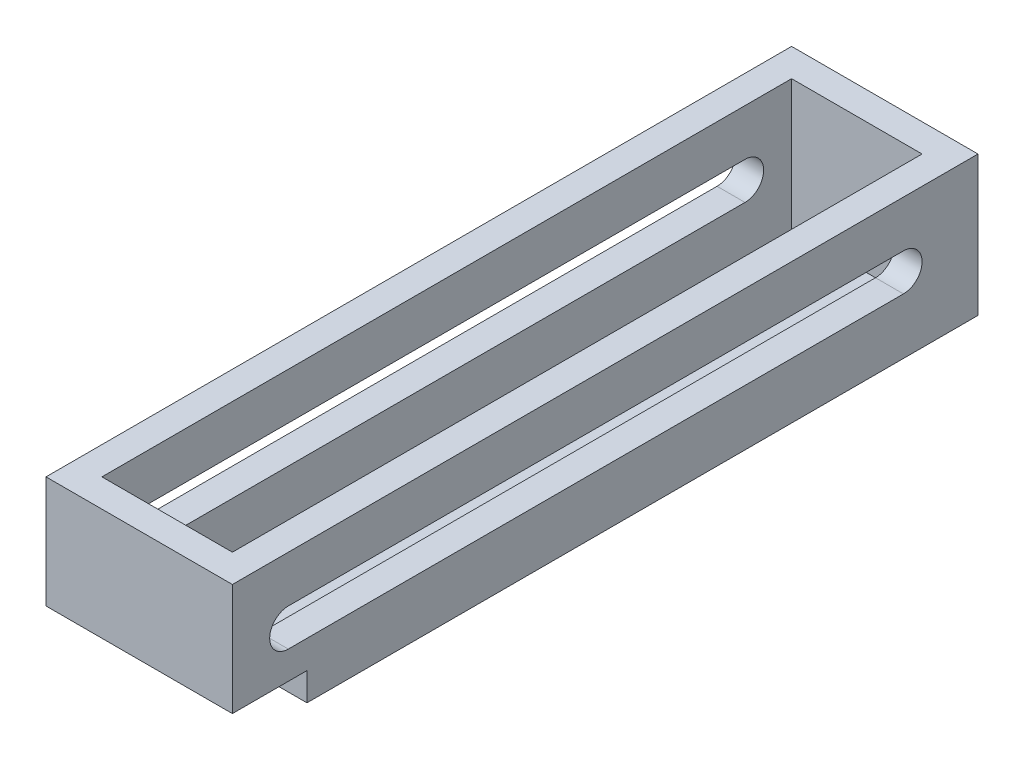
ISO-10303-21;
HEADER;
FILE_DESCRIPTION(('STEP AP214'),'2;1');
FILE_NAME('part.step','',(''),(''),'','','');
FILE_SCHEMA(('AUTOMOTIVE_DESIGN { 1 0 10303 214 1 1 1 1 }'));
ENDSEC;
DATA;
#1=APPLICATION_CONTEXT('core data for automotive mechanical design processes');
#2=APPLICATION_PROTOCOL_DEFINITION('international standard','automotive_design',2000,#1);
#3=PRODUCT_CONTEXT('',#1,'mechanical');
#4=PRODUCT('Part','Part','',(#3));
#5=PRODUCT_RELATED_PRODUCT_CATEGORY('part','',(#4));
#6=PRODUCT_DEFINITION_FORMATION('','',#4);
#7=PRODUCT_DEFINITION_CONTEXT('part definition',#1,'design');
#8=PRODUCT_DEFINITION('design','',#6,#7);
#9=PRODUCT_DEFINITION_SHAPE('','',#8);
#10=(LENGTH_UNIT() NAMED_UNIT(*) SI_UNIT(.MILLI.,.METRE.));
#11=(NAMED_UNIT(*) PLANE_ANGLE_UNIT() SI_UNIT($,.RADIAN.));
#12=(NAMED_UNIT(*) SI_UNIT($,.STERADIAN.) SOLID_ANGLE_UNIT());
#13=UNCERTAINTY_MEASURE_WITH_UNIT(LENGTH_MEASURE(1.E-05),#10,'distance_accuracy_value','');
#14=(GEOMETRIC_REPRESENTATION_CONTEXT(3) GLOBAL_UNCERTAINTY_ASSIGNED_CONTEXT((#13)) GLOBAL_UNIT_ASSIGNED_CONTEXT((#10,
#11,#12)) REPRESENTATION_CONTEXT('',''));
#15=CARTESIAN_POINT('',(0.,0.,0.));
#16=DIRECTION('',(0.,0.,1.));
#17=DIRECTION('',(1.,0.,0.));
#18=AXIS2_PLACEMENT_3D('',#15,#16,#17);
#19=CARTESIAN_POINT('',(63.5,95.25,-254.));
#20=DIRECTION('',(-1.,0.,0.));
#21=DIRECTION('',(0.,0.,1.));
#22=AXIS2_PLACEMENT_3D('',#19,#20,#21);
#23=PLANE('',#22);
#24=DIRECTION('',(0.,0.,1.));
#25=VECTOR('',#24,1.);
#26=CARTESIAN_POINT('',(63.5,63.5,-203.2));
#27=LINE('',#26,#25);
#28=CARTESIAN_POINT('',(63.5,63.5,-203.2));
#29=VERTEX_POINT('',#28);
#30=CARTESIAN_POINT('',(63.5,63.4999999999999,215.9));
#31=VERTEX_POINT('',#30);
#32=EDGE_CURVE('E318',#29,#31,#27,.T.);
#33=ORIENTED_EDGE('',*,*,#32,.F.);
#34=CARTESIAN_POINT('',(63.5,50.8,-203.2));
#35=DIRECTION('',(1.,0.,0.));
#36=DIRECTION('',(0.,0.,-1.));
#37=AXIS2_PLACEMENT_3D('',#34,#35,#36);
#38=CIRCLE('',#37,12.7);
#39=CARTESIAN_POINT('',(63.5,38.1,-203.2));
#40=VERTEX_POINT('',#39);
#41=EDGE_CURVE('E302',#40,#29,#38,.T.);
#42=ORIENTED_EDGE('',*,*,#41,.F.);
#43=DIRECTION('',(0.,0.,-1.));
#44=VECTOR('',#43,1.);
#45=CARTESIAN_POINT('',(63.5,38.1,-203.2));
#46=LINE('',#45,#44);
#47=CARTESIAN_POINT('',(63.5,38.1,215.9));
#48=VERTEX_POINT('',#47);
#49=EDGE_CURVE('E307',#48,#40,#46,.T.);
#50=ORIENTED_EDGE('',*,*,#49,.F.);
#51=CARTESIAN_POINT('',(63.5,50.7999999999999,215.9));
#52=DIRECTION('',(1.,0.,0.));
#53=DIRECTION('',(0.,0.,-1.));
#54=AXIS2_PLACEMENT_3D('',#51,#52,#53);
#55=CIRCLE('',#54,12.7);
#56=EDGE_CURVE('E321',#31,#48,#55,.T.);
#57=ORIENTED_EDGE('',*,*,#56,.F.);
#58=EDGE_LOOP('',(#33,#42,#50,#57));
#59=FACE_BOUND('',#58,.T.);
#60=DIRECTION('',(0.,-1.,0.));
#61=VECTOR('',#60,1.);
#62=CARTESIAN_POINT('',(63.5,95.25,254.));
#63=LINE('',#62,#61);
#64=CARTESIAN_POINT('',(63.5,95.25,254.));
#65=VERTEX_POINT('',#64);
#66=CARTESIAN_POINT('',(63.5,19.05,254.));
#67=VERTEX_POINT('',#66);
#68=EDGE_CURVE('E204',#65,#67,#63,.T.);
#69=ORIENTED_EDGE('',*,*,#68,.T.);
#70=DIRECTION('',(0.,0.,1.));
#71=VECTOR('',#70,1.);
#72=CARTESIAN_POINT('',(63.5,19.05,203.2));
#73=LINE('',#72,#71);
#74=CARTESIAN_POINT('',(63.5,19.05,203.2));
#75=VERTEX_POINT('',#74);
#76=EDGE_CURVE('E186',#75,#67,#73,.T.);
#77=ORIENTED_EDGE('',*,*,#76,.F.);
#78=DIRECTION('',(0.,1.,0.));
#79=VECTOR('',#78,1.);
#80=CARTESIAN_POINT('',(63.5,19.05,203.2));
#81=LINE('',#80,#79);
#82=CARTESIAN_POINT('',(63.5,0.,203.2));
#83=VERTEX_POINT('',#82);
#84=EDGE_CURVE('E173',#83,#75,#81,.T.);
#85=ORIENTED_EDGE('',*,*,#84,.F.);
#86=DIRECTION('',(0.,0.,-1.));
#87=VECTOR('',#86,1.);
#88=CARTESIAN_POINT('',(63.5,0.,-254.));
#89=LINE('',#88,#87);
#90=CARTESIAN_POINT('',(63.5,0.,-254.));
#91=VERTEX_POINT('',#90);
#92=EDGE_CURVE('E184',#83,#91,#89,.T.);
#93=ORIENTED_EDGE('',*,*,#92,.T.);
#94=DIRECTION('',(0.,-1.,0.));
#95=VECTOR('',#94,1.);
#96=CARTESIAN_POINT('',(63.5,95.25,-254.));
#97=LINE('',#96,#95);
#98=CARTESIAN_POINT('',(63.5,95.25,-254.));
#99=VERTEX_POINT('',#98);
#100=EDGE_CURVE('E212',#99,#91,#97,.T.);
#101=ORIENTED_EDGE('',*,*,#100,.F.);
#102=DIRECTION('',(0.,0.,-1.));
#103=VECTOR('',#102,1.);
#104=CARTESIAN_POINT('',(63.5,95.25,-254.));
#105=LINE('',#104,#103);
#106=EDGE_CURVE('E203',#65,#99,#105,.T.);
#107=ORIENTED_EDGE('',*,*,#106,.F.);
#108=EDGE_LOOP('',(#69,#77,#85,#93,#101,#107));
#109=FACE_BOUND('',#108,.T.);
#110=ADVANCED_FACE('F37',(#59,#109),#23,.F.);
#111=CARTESIAN_POINT('',(-63.5,95.25,-254.));
#112=DIRECTION('',(0.,0.,1.));
#113=DIRECTION('',(1.,0.,0.));
#114=AXIS2_PLACEMENT_3D('',#111,#112,#113);
#115=PLANE('',#114);
#116=DIRECTION('',(-1.,0.,0.));
#117=VECTOR('',#116,1.);
#118=CARTESIAN_POINT('',(-63.5,0.,-254.));
#119=LINE('',#118,#117);
#120=CARTESIAN_POINT('',(-63.5,0.,-254.));
#121=VERTEX_POINT('',#120);
#122=EDGE_CURVE('E190',#91,#121,#119,.T.);
#123=ORIENTED_EDGE('',*,*,#122,.T.);
#124=DIRECTION('',(0.,-1.,0.));
#125=VECTOR('',#124,1.);
#126=CARTESIAN_POINT('',(-63.5,95.25,-254.));
#127=LINE('',#126,#125);
#128=CARTESIAN_POINT('',(-63.5,95.25,-254.));
#129=VERTEX_POINT('',#128);
#130=EDGE_CURVE('E209',#129,#121,#127,.T.);
#131=ORIENTED_EDGE('',*,*,#130,.F.);
#132=DIRECTION('',(-1.,0.,0.));
#133=VECTOR('',#132,1.);
#134=CARTESIAN_POINT('',(-63.5,95.25,-254.));
#135=LINE('',#134,#133);
#136=EDGE_CURVE('E265',#99,#129,#135,.T.);
#137=ORIENTED_EDGE('',*,*,#136,.F.);
#138=ORIENTED_EDGE('',*,*,#100,.T.);
#139=EDGE_LOOP('',(#123,#131,#137,#138));
#140=FACE_BOUND('',#139,.T.);
#141=ADVANCED_FACE('F279',(#140),#115,.F.);
#142=CARTESIAN_POINT('',(-63.5,95.25,-254.));
#143=DIRECTION('',(1.,0.,0.));
#144=DIRECTION('',(0.,0.,-1.));
#145=AXIS2_PLACEMENT_3D('',#142,#143,#144);
#146=PLANE('',#145);
#147=DIRECTION('',(0.,0.,-1.));
#148=VECTOR('',#147,1.);
#149=CARTESIAN_POINT('',(-63.5000000000001,38.1,-203.2));
#150=LINE('',#149,#148);
#151=CARTESIAN_POINT('',(-63.5,38.1,215.9));
#152=VERTEX_POINT('',#151);
#153=CARTESIAN_POINT('',(-63.5000000000001,38.1,-203.2));
#154=VERTEX_POINT('',#153);
#155=EDGE_CURVE('E313',#152,#154,#150,.T.);
#156=ORIENTED_EDGE('',*,*,#155,.T.);
#157=CARTESIAN_POINT('',(-63.5000000000001,50.8,-203.2));
#158=DIRECTION('',(1.,0.,0.));
#159=DIRECTION('',(0.,0.,-1.));
#160=AXIS2_PLACEMENT_3D('',#157,#158,#159);
#161=CIRCLE('',#160,12.7);
#162=CARTESIAN_POINT('',(-63.5000000000001,63.5,-203.2));
#163=VERTEX_POINT('',#162);
#164=EDGE_CURVE('E303',#154,#163,#161,.T.);
#165=ORIENTED_EDGE('',*,*,#164,.T.);
#166=DIRECTION('',(0.,0.,1.));
#167=VECTOR('',#166,1.);
#168=CARTESIAN_POINT('',(-63.5000000000001,63.5,-203.2));
#169=LINE('',#168,#167);
#170=CARTESIAN_POINT('',(-63.5,63.4999999999999,215.9));
#171=VERTEX_POINT('',#170);
#172=EDGE_CURVE('E306',#163,#171,#169,.T.);
#173=ORIENTED_EDGE('',*,*,#172,.T.);
#174=CARTESIAN_POINT('',(-63.5,50.7999999999999,215.9));
#175=DIRECTION('',(1.,0.,0.));
#176=DIRECTION('',(0.,0.,-1.));
#177=AXIS2_PLACEMENT_3D('',#174,#175,#176);
#178=CIRCLE('',#177,12.7);
#179=EDGE_CURVE('E310',#171,#152,#178,.T.);
#180=ORIENTED_EDGE('',*,*,#179,.T.);
#181=EDGE_LOOP('',(#156,#165,#173,#180));
#182=FACE_BOUND('',#181,.T.);
#183=DIRECTION('',(0.,-1.,0.));
#184=VECTOR('',#183,1.);
#185=CARTESIAN_POINT('',(-63.5,0.,203.2));
#186=LINE('',#185,#184);
#187=CARTESIAN_POINT('',(-63.5,19.05,203.2));
#188=VERTEX_POINT('',#187);
#189=CARTESIAN_POINT('',(-63.5,0.,203.2));
#190=VERTEX_POINT('',#189);
#191=EDGE_CURVE('E51',#188,#190,#186,.T.);
#192=ORIENTED_EDGE('',*,*,#191,.F.);
#193=DIRECTION('',(0.,0.,1.));
#194=VECTOR('',#193,1.);
#195=CARTESIAN_POINT('',(-63.5,19.05,203.2));
#196=LINE('',#195,#194);
#197=CARTESIAN_POINT('',(-63.5,19.05,254.));
#198=VERTEX_POINT('',#197);
#199=EDGE_CURVE('E285',#188,#198,#196,.T.);
#200=ORIENTED_EDGE('',*,*,#199,.T.);
#201=DIRECTION('',(0.,-1.,0.));
#202=VECTOR('',#201,1.);
#203=CARTESIAN_POINT('',(-63.5,95.25,254.));
#204=LINE('',#203,#202);
#205=CARTESIAN_POINT('',(-63.5,95.25,254.));
#206=VERTEX_POINT('',#205);
#207=EDGE_CURVE('E206',#206,#198,#204,.T.);
#208=ORIENTED_EDGE('',*,*,#207,.F.);
#209=DIRECTION('',(0.,0.,1.));
#210=VECTOR('',#209,1.);
#211=CARTESIAN_POINT('',(-63.5,95.25,-254.));
#212=LINE('',#211,#210);
#213=EDGE_CURVE('E266',#129,#206,#212,.T.);
#214=ORIENTED_EDGE('',*,*,#213,.F.);
#215=ORIENTED_EDGE('',*,*,#130,.T.);
#216=DIRECTION('',(0.,0.,1.));
#217=VECTOR('',#216,1.);
#218=CARTESIAN_POINT('',(-63.5,0.,-254.));
#219=LINE('',#218,#217);
#220=EDGE_CURVE('E194',#121,#190,#219,.T.);
#221=ORIENTED_EDGE('',*,*,#220,.T.);
#222=EDGE_LOOP('',(#192,#200,#208,#214,#215,#221));
#223=FACE_BOUND('',#222,.T.);
#224=ADVANCED_FACE('F282',(#182,#223),#146,.F.);
#225=CARTESIAN_POINT('',(-63.5,95.25,254.));
#226=DIRECTION('',(0.,0.,-1.));
#227=DIRECTION('',(-1.,0.,0.));
#228=AXIS2_PLACEMENT_3D('',#225,#226,#227);
#229=PLANE('',#228);
#230=ORIENTED_EDGE('',*,*,#207,.T.);
#231=DIRECTION('',(-1.,0.,0.));
#232=VECTOR('',#231,1.);
#233=CARTESIAN_POINT('',(-63.5,19.05,254.));
#234=LINE('',#233,#232);
#235=EDGE_CURVE('E277',#67,#198,#234,.T.);
#236=ORIENTED_EDGE('',*,*,#235,.F.);
#237=ORIENTED_EDGE('',*,*,#68,.F.);
#238=DIRECTION('',(1.,0.,0.));
#239=VECTOR('',#238,1.);
#240=CARTESIAN_POINT('',(-63.5,95.25,254.));
#241=LINE('',#240,#239);
#242=EDGE_CURVE('E199',#206,#65,#241,.T.);
#243=ORIENTED_EDGE('',*,*,#242,.F.);
#244=EDGE_LOOP('',(#230,#236,#237,#243));
#245=FACE_BOUND('',#244,.T.);
#246=ADVANCED_FACE('F276',(#245),#229,.F.);
#247=CARTESIAN_POINT('',(0.,95.25,0.));
#248=DIRECTION('',(0.,1.,0.));
#249=DIRECTION('',(0.,0.,1.));
#250=AXIS2_PLACEMENT_3D('',#247,#248,#249);
#251=PLANE('',#250);
#252=DIRECTION('',(0.,0.,1.));
#253=VECTOR('',#252,1.);
#254=CARTESIAN_POINT('',(-44.45,95.25,234.95));
#255=LINE('',#254,#253);
#256=CARTESIAN_POINT('',(-44.45,95.25,-234.95));
#257=VERTEX_POINT('',#256);
#258=CARTESIAN_POINT('',(-44.45,95.25,234.95));
#259=VERTEX_POINT('',#258);
#260=EDGE_CURVE('E248',#257,#259,#255,.T.);
#261=ORIENTED_EDGE('',*,*,#260,.F.);
#262=DIRECTION('',(-1.,0.,0.));
#263=VECTOR('',#262,1.);
#264=CARTESIAN_POINT('',(-44.45,95.25,-234.95));
#265=LINE('',#264,#263);
#266=CARTESIAN_POINT('',(44.45,95.25,-234.95));
#267=VERTEX_POINT('',#266);
#268=EDGE_CURVE('E244',#267,#257,#265,.T.);
#269=ORIENTED_EDGE('',*,*,#268,.F.);
#270=DIRECTION('',(0.,0.,-1.));
#271=VECTOR('',#270,1.);
#272=CARTESIAN_POINT('',(44.45,95.25,-234.95));
#273=LINE('',#272,#271);
#274=CARTESIAN_POINT('',(44.4500000000001,95.25,234.95));
#275=VERTEX_POINT('',#274);
#276=EDGE_CURVE('E255',#275,#267,#273,.T.);
#277=ORIENTED_EDGE('',*,*,#276,.F.);
#278=DIRECTION('',(1.,0.,0.));
#279=VECTOR('',#278,1.);
#280=CARTESIAN_POINT('',(44.4500000000001,95.25,234.95));
#281=LINE('',#280,#279);
#282=EDGE_CURVE('E251',#259,#275,#281,.T.);
#283=ORIENTED_EDGE('',*,*,#282,.F.);
#284=EDGE_LOOP('',(#261,#269,#277,#283));
#285=FACE_BOUND('',#284,.T.);
#286=ORIENTED_EDGE('',*,*,#106,.T.);
#287=ORIENTED_EDGE('',*,*,#136,.T.);
#288=ORIENTED_EDGE('',*,*,#213,.T.);
#289=ORIENTED_EDGE('',*,*,#242,.T.);
#290=EDGE_LOOP('',(#286,#287,#288,#289));
#291=FACE_BOUND('',#290,.T.);
#292=ADVANCED_FACE('F272',(#285,#291),#251,.T.);
#293=CARTESIAN_POINT('',(0.,0.,0.));
#294=DIRECTION('',(0.,1.,0.));
#295=DIRECTION('',(0.,0.,1.));
#296=AXIS2_PLACEMENT_3D('',#293,#294,#295);
#297=PLANE('',#296);
#298=ORIENTED_EDGE('',*,*,#92,.F.);
#299=DIRECTION('',(1.,0.,0.));
#300=VECTOR('',#299,1.);
#301=CARTESIAN_POINT('',(63.5,0.,203.2));
#302=LINE('',#301,#300);
#303=EDGE_CURVE('E170',#190,#83,#302,.T.);
#304=ORIENTED_EDGE('',*,*,#303,.F.);
#305=ORIENTED_EDGE('',*,*,#220,.F.);
#306=ORIENTED_EDGE('',*,*,#122,.F.);
#307=EDGE_LOOP('',(#298,#304,#305,#306));
#308=FACE_BOUND('',#307,.T.);
#309=ADVANCED_FACE('F189',(#308),#297,.F.);
#310=CARTESIAN_POINT('',(-44.45,6.35000000000001,234.95));
#311=DIRECTION('',(-1.,0.,0.));
#312=DIRECTION('',(0.,0.,1.));
#313=AXIS2_PLACEMENT_3D('',#310,#311,#312);
#314=PLANE('',#313);
#315=DIRECTION('',(0.,0.,-1.));
#316=VECTOR('',#315,1.);
#317=CARTESIAN_POINT('',(-44.45,63.4999999999999,234.95));
#318=LINE('',#317,#316);
#319=CARTESIAN_POINT('',(-44.45,63.4999999999999,215.9));
#320=VERTEX_POINT('',#319);
#321=CARTESIAN_POINT('',(-44.45,63.5,-203.2));
#322=VERTEX_POINT('',#321);
#323=EDGE_CURVE('E329',#320,#322,#318,.T.);
#324=ORIENTED_EDGE('',*,*,#323,.T.);
#325=CARTESIAN_POINT('',(-44.45,50.8,-203.2));
#326=DIRECTION('',(-1.,0.,0.));
#327=DIRECTION('',(0.,0.,1.));
#328=AXIS2_PLACEMENT_3D('',#325,#326,#327);
#329=CIRCLE('',#328,12.7);
#330=CARTESIAN_POINT('',(-44.45,38.1,-203.2));
#331=VERTEX_POINT('',#330);
#332=EDGE_CURVE('E252',#322,#331,#329,.T.);
#333=ORIENTED_EDGE('',*,*,#332,.T.);
#334=DIRECTION('',(0.,0.,1.));
#335=VECTOR('',#334,1.);
#336=CARTESIAN_POINT('',(-44.45,38.1,234.95));
#337=LINE('',#336,#335);
#338=CARTESIAN_POINT('',(-44.45,38.1,215.9));
#339=VERTEX_POINT('',#338);
#340=EDGE_CURVE('E346',#331,#339,#337,.T.);
#341=ORIENTED_EDGE('',*,*,#340,.T.);
#342=CARTESIAN_POINT('',(-44.45,50.7999999999999,215.9));
#343=DIRECTION('',(-1.,0.,0.));
#344=DIRECTION('',(0.,0.,1.));
#345=AXIS2_PLACEMENT_3D('',#342,#343,#344);
#346=CIRCLE('',#345,12.7);
#347=EDGE_CURVE('E343',#339,#320,#346,.T.);
#348=ORIENTED_EDGE('',*,*,#347,.T.);
#349=EDGE_LOOP('',(#324,#333,#341,#348));
#350=FACE_BOUND('',#349,.T.);
#351=DIRECTION('',(0.,1.,0.));
#352=VECTOR('',#351,1.);
#353=CARTESIAN_POINT('',(-44.45,6.35000000000001,234.95));
#354=LINE('',#353,#352);
#355=CARTESIAN_POINT('',(-44.45,19.05,234.95));
#356=VERTEX_POINT('',#355);
#357=EDGE_CURVE('E242',#356,#259,#354,.T.);
#358=ORIENTED_EDGE('',*,*,#357,.F.);
#359=DIRECTION('',(0.,0.,-1.));
#360=VECTOR('',#359,1.);
#361=CARTESIAN_POINT('',(-44.45,19.05,234.95));
#362=LINE('',#361,#360);
#363=CARTESIAN_POINT('',(-44.45,19.05,203.2));
#364=VERTEX_POINT('',#363);
#365=EDGE_CURVE('E299',#356,#364,#362,.T.);
#366=ORIENTED_EDGE('',*,*,#365,.T.);
#367=DIRECTION('',(0.,-1.,0.));
#368=VECTOR('',#367,1.);
#369=CARTESIAN_POINT('',(-44.45,6.35000000000001,203.2));
#370=LINE('',#369,#368);
#371=CARTESIAN_POINT('',(-44.45,6.35000000000001,203.2));
#372=VERTEX_POINT('',#371);
#373=EDGE_CURVE('E289',#364,#372,#370,.T.);
#374=ORIENTED_EDGE('',*,*,#373,.T.);
#375=DIRECTION('',(0.,0.,1.));
#376=VECTOR('',#375,1.);
#377=CARTESIAN_POINT('',(-44.45,6.35000000000001,234.95));
#378=LINE('',#377,#376);
#379=CARTESIAN_POINT('',(-44.45,6.35000000000001,-234.95));
#380=VERTEX_POINT('',#379);
#381=EDGE_CURVE('E233',#380,#372,#378,.T.);
#382=ORIENTED_EDGE('',*,*,#381,.F.);
#383=DIRECTION('',(0.,1.,0.));
#384=VECTOR('',#383,1.);
#385=CARTESIAN_POINT('',(-44.45,6.35000000000001,-234.95));
#386=LINE('',#385,#384);
#387=EDGE_CURVE('E192',#380,#257,#386,.T.);
#388=ORIENTED_EDGE('',*,*,#387,.T.);
#389=ORIENTED_EDGE('',*,*,#260,.T.);
#390=EDGE_LOOP('',(#358,#366,#374,#382,#388,#389));
#391=FACE_BOUND('',#390,.T.);
#392=ADVANCED_FACE('F351',(#350,#391),#314,.F.);
#393=CARTESIAN_POINT('',(-44.45,6.35000000000001,-234.95));
#394=DIRECTION('',(0.,0.,-1.));
#395=DIRECTION('',(-1.,0.,0.));
#396=AXIS2_PLACEMENT_3D('',#393,#394,#395);
#397=PLANE('',#396);
#398=ORIENTED_EDGE('',*,*,#268,.T.);
#399=ORIENTED_EDGE('',*,*,#387,.F.);
#400=DIRECTION('',(-1.,0.,0.));
#401=VECTOR('',#400,1.);
#402=CARTESIAN_POINT('',(-44.45,6.35000000000001,-234.95));
#403=LINE('',#402,#401);
#404=CARTESIAN_POINT('',(44.45,6.35000000000001,-234.95));
#405=VERTEX_POINT('',#404);
#406=EDGE_CURVE('E240',#405,#380,#403,.T.);
#407=ORIENTED_EDGE('',*,*,#406,.F.);
#408=DIRECTION('',(0.,1.,0.));
#409=VECTOR('',#408,1.);
#410=CARTESIAN_POINT('',(44.45,6.35000000000001,-234.95));
#411=LINE('',#410,#409);
#412=EDGE_CURVE('E196',#405,#267,#411,.T.);
#413=ORIENTED_EDGE('',*,*,#412,.T.);
#414=EDGE_LOOP('',(#398,#399,#407,#413));
#415=FACE_BOUND('',#414,.T.);
#416=ADVANCED_FACE('F464',(#415),#397,.F.);
#417=CARTESIAN_POINT('',(44.45,6.35000000000001,-234.95));
#418=DIRECTION('',(1.,0.,0.));
#419=DIRECTION('',(0.,0.,-1.));
#420=AXIS2_PLACEMENT_3D('',#417,#418,#419);
#421=PLANE('',#420);
#422=DIRECTION('',(0.,0.,-1.));
#423=VECTOR('',#422,1.);
#424=CARTESIAN_POINT('',(44.45,38.1,-234.95));
#425=LINE('',#424,#423);
#426=CARTESIAN_POINT('',(44.4500000000001,38.1,215.9));
#427=VERTEX_POINT('',#426);
#428=CARTESIAN_POINT('',(44.4500000000001,38.1,-203.2));
#429=VERTEX_POINT('',#428);
#430=EDGE_CURVE('E220',#427,#429,#425,.T.);
#431=ORIENTED_EDGE('',*,*,#430,.T.);
#432=CARTESIAN_POINT('',(44.45,50.8,-203.2));
#433=DIRECTION('',(1.,0.,0.));
#434=DIRECTION('',(0.,0.,-1.));
#435=AXIS2_PLACEMENT_3D('',#432,#433,#434);
#436=CIRCLE('',#435,12.7);
#437=CARTESIAN_POINT('',(44.4500000000001,63.5,-203.2));
#438=VERTEX_POINT('',#437);
#439=EDGE_CURVE('E223',#429,#438,#436,.T.);
#440=ORIENTED_EDGE('',*,*,#439,.T.);
#441=DIRECTION('',(0.,0.,1.));
#442=VECTOR('',#441,1.);
#443=CARTESIAN_POINT('',(44.45,63.5,-234.95));
#444=LINE('',#443,#442);
#445=CARTESIAN_POINT('',(44.4500000000001,63.4999999999999,215.9));
#446=VERTEX_POINT('',#445);
#447=EDGE_CURVE('E214',#438,#446,#444,.T.);
#448=ORIENTED_EDGE('',*,*,#447,.T.);
#449=CARTESIAN_POINT('',(44.4500000000001,50.7999999999999,215.9));
#450=DIRECTION('',(1.,0.,0.));
#451=DIRECTION('',(0.,0.,-1.));
#452=AXIS2_PLACEMENT_3D('',#449,#450,#451);
#453=CIRCLE('',#452,12.7);
#454=EDGE_CURVE('E217',#446,#427,#453,.T.);
#455=ORIENTED_EDGE('',*,*,#454,.T.);
#456=EDGE_LOOP('',(#431,#440,#448,#455));
#457=FACE_BOUND('',#456,.T.);
#458=DIRECTION('',(0.,1.,0.));
#459=VECTOR('',#458,1.);
#460=CARTESIAN_POINT('',(44.4500000000001,6.35000000000001,203.2));
#461=LINE('',#460,#459);
#462=CARTESIAN_POINT('',(44.4500000000001,6.35000000000001,203.2));
#463=VERTEX_POINT('',#462);
#464=CARTESIAN_POINT('',(44.4500000000001,19.05,203.2));
#465=VERTEX_POINT('',#464);
#466=EDGE_CURVE('E58',#463,#465,#461,.T.);
#467=ORIENTED_EDGE('',*,*,#466,.T.);
#468=DIRECTION('',(0.,0.,1.));
#469=VECTOR('',#468,1.);
#470=CARTESIAN_POINT('',(44.45,19.05,-234.95));
#471=LINE('',#470,#469);
#472=CARTESIAN_POINT('',(44.4500000000001,19.05,234.95));
#473=VERTEX_POINT('',#472);
#474=EDGE_CURVE('E297',#465,#473,#471,.T.);
#475=ORIENTED_EDGE('',*,*,#474,.T.);
#476=DIRECTION('',(0.,1.,0.));
#477=VECTOR('',#476,1.);
#478=CARTESIAN_POINT('',(44.4500000000001,6.35000000000001,234.95));
#479=LINE('',#478,#477);
#480=EDGE_CURVE('E260',#473,#275,#479,.T.);
#481=ORIENTED_EDGE('',*,*,#480,.T.);
#482=ORIENTED_EDGE('',*,*,#276,.T.);
#483=ORIENTED_EDGE('',*,*,#412,.F.);
#484=DIRECTION('',(0.,0.,-1.));
#485=VECTOR('',#484,1.);
#486=CARTESIAN_POINT('',(44.45,6.35000000000001,-234.95));
#487=LINE('',#486,#485);
#488=EDGE_CURVE('E230',#463,#405,#487,.T.);
#489=ORIENTED_EDGE('',*,*,#488,.F.);
#490=EDGE_LOOP('',(#467,#475,#481,#482,#483,#489));
#491=FACE_BOUND('',#490,.T.);
#492=ADVANCED_FACE('F236',(#457,#491),#421,.F.);
#493=CARTESIAN_POINT('',(44.4500000000001,6.35000000000001,234.95));
#494=DIRECTION('',(0.,0.,1.));
#495=DIRECTION('',(1.,0.,0.));
#496=AXIS2_PLACEMENT_3D('',#493,#494,#495);
#497=PLANE('',#496);
#498=ORIENTED_EDGE('',*,*,#480,.F.);
#499=DIRECTION('',(-1.,0.,0.));
#500=VECTOR('',#499,1.);
#501=CARTESIAN_POINT('',(44.4500000000001,19.05,234.95));
#502=LINE('',#501,#500);
#503=EDGE_CURVE('E11',#473,#356,#502,.T.);
#504=ORIENTED_EDGE('',*,*,#503,.T.);
#505=ORIENTED_EDGE('',*,*,#357,.T.);
#506=ORIENTED_EDGE('',*,*,#282,.T.);
#507=EDGE_LOOP('',(#498,#504,#505,#506));
#508=FACE_BOUND('',#507,.T.);
#509=ADVANCED_FACE('F475',(#508),#497,.F.);
#510=CARTESIAN_POINT('',(0.,6.35000000000001,0.));
#511=DIRECTION('',(0.,-1.,0.));
#512=DIRECTION('',(0.,0.,-1.));
#513=AXIS2_PLACEMENT_3D('',#510,#511,#512);
#514=PLANE('',#513);
#515=ORIENTED_EDGE('',*,*,#381,.T.);
#516=DIRECTION('',(1.,0.,0.));
#517=VECTOR('',#516,1.);
#518=CARTESIAN_POINT('',(0.,6.35000000000001,203.2));
#519=LINE('',#518,#517);
#520=EDGE_CURVE('E44',#372,#463,#519,.T.);
#521=ORIENTED_EDGE('',*,*,#520,.T.);
#522=ORIENTED_EDGE('',*,*,#488,.T.);
#523=ORIENTED_EDGE('',*,*,#406,.T.);
#524=EDGE_LOOP('',(#515,#521,#522,#523));
#525=FACE_BOUND('',#524,.T.);
#526=ADVANCED_FACE('F228',(#525),#514,.F.);
#527=CARTESIAN_POINT('',(-63.5000000000001,63.5,-203.2));
#528=DIRECTION('',(0.,1.,0.));
#529=DIRECTION('',(0.,0.,1.));
#530=AXIS2_PLACEMENT_3D('',#527,#528,#529);
#531=PLANE('',#530);
#532=DIRECTION('',(1.,0.,0.));
#533=VECTOR('',#532,1.);
#534=CARTESIAN_POINT('',(-63.5000000000001,63.5,-203.2));
#535=LINE('',#534,#533);
#536=EDGE_CURVE('E316',#438,#29,#535,.T.);
#537=ORIENTED_EDGE('',*,*,#536,.T.);
#538=ORIENTED_EDGE('',*,*,#32,.T.);
#539=DIRECTION('',(1.,0.,0.));
#540=VECTOR('',#539,1.);
#541=CARTESIAN_POINT('',(-63.5,63.4999999999999,215.9));
#542=LINE('',#541,#540);
#543=EDGE_CURVE('E338',#446,#31,#542,.T.);
#544=ORIENTED_EDGE('',*,*,#543,.F.);
#545=ORIENTED_EDGE('',*,*,#447,.F.);
#546=EDGE_LOOP('',(#537,#538,#544,#545));
#547=FACE_BOUND('',#546,.T.);
#548=ADVANCED_FACE('F383',(#547),#531,.F.);
#549=CARTESIAN_POINT('',(-63.5,50.7999999999999,215.9));
#550=DIRECTION('',(1.,0.,0.));
#551=DIRECTION('',(0.,0.,-1.));
#552=AXIS2_PLACEMENT_3D('',#549,#550,#551);
#553=CYLINDRICAL_SURFACE('',#552,12.7);
#554=ORIENTED_EDGE('',*,*,#543,.T.);
#555=ORIENTED_EDGE('',*,*,#56,.T.);
#556=DIRECTION('',(1.,0.,0.));
#557=VECTOR('',#556,1.);
#558=CARTESIAN_POINT('',(-63.5,38.1,215.9));
#559=LINE('',#558,#557);
#560=EDGE_CURVE('E334',#427,#48,#559,.T.);
#561=ORIENTED_EDGE('',*,*,#560,.F.);
#562=ORIENTED_EDGE('',*,*,#454,.F.);
#563=EDGE_LOOP('',(#554,#555,#561,#562));
#564=FACE_BOUND('',#563,.T.);
#565=ADVANCED_FACE('F394',(#564),#553,.F.);
#566=CARTESIAN_POINT('',(-63.5000000000001,38.1,-203.2));
#567=DIRECTION('',(0.,-1.,0.));
#568=DIRECTION('',(0.,0.,-1.));
#569=AXIS2_PLACEMENT_3D('',#566,#567,#568);
#570=PLANE('',#569);
#571=ORIENTED_EDGE('',*,*,#560,.T.);
#572=ORIENTED_EDGE('',*,*,#49,.T.);
#573=DIRECTION('',(1.,0.,0.));
#574=VECTOR('',#573,1.);
#575=CARTESIAN_POINT('',(-63.5000000000001,38.1,-203.2));
#576=LINE('',#575,#574);
#577=EDGE_CURVE('E330',#429,#40,#576,.T.);
#578=ORIENTED_EDGE('',*,*,#577,.F.);
#579=ORIENTED_EDGE('',*,*,#430,.F.);
#580=EDGE_LOOP('',(#571,#572,#578,#579));
#581=FACE_BOUND('',#580,.T.);
#582=ADVANCED_FACE('F392',(#581),#570,.F.);
#583=CARTESIAN_POINT('',(-63.5000000000001,50.8,-203.2));
#584=DIRECTION('',(1.,0.,0.));
#585=DIRECTION('',(0.,0.,-1.));
#586=AXIS2_PLACEMENT_3D('',#583,#584,#585);
#587=CYLINDRICAL_SURFACE('',#586,12.7);
#588=ORIENTED_EDGE('',*,*,#577,.T.);
#589=ORIENTED_EDGE('',*,*,#41,.T.);
#590=ORIENTED_EDGE('',*,*,#536,.F.);
#591=ORIENTED_EDGE('',*,*,#439,.F.);
#592=EDGE_LOOP('',(#588,#589,#590,#591));
#593=FACE_BOUND('',#592,.T.);
#594=ADVANCED_FACE('F387',(#593),#587,.F.);
#595=EDGE_CURVE('E339',#163,#322,#535,.T.);
#596=ORIENTED_EDGE('',*,*,#595,.F.);
#597=ORIENTED_EDGE('',*,*,#164,.F.);
#598=EDGE_CURVE('E326',#154,#331,#576,.T.);
#599=ORIENTED_EDGE('',*,*,#598,.T.);
#600=ORIENTED_EDGE('',*,*,#332,.F.);
#601=EDGE_LOOP('',(#596,#597,#599,#600));
#602=FACE_BOUND('',#601,.T.);
#603=ADVANCED_FACE('F354',(#602),#587,.F.);
#604=ORIENTED_EDGE('',*,*,#598,.F.);
#605=ORIENTED_EDGE('',*,*,#155,.F.);
#606=EDGE_CURVE('E331',#152,#339,#559,.T.);
#607=ORIENTED_EDGE('',*,*,#606,.T.);
#608=ORIENTED_EDGE('',*,*,#340,.F.);
#609=EDGE_LOOP('',(#604,#605,#607,#608));
#610=FACE_BOUND('',#609,.T.);
#611=ADVANCED_FACE('F359',(#610),#570,.F.);
#612=ORIENTED_EDGE('',*,*,#606,.F.);
#613=ORIENTED_EDGE('',*,*,#179,.F.);
#614=EDGE_CURVE('E335',#171,#320,#542,.T.);
#615=ORIENTED_EDGE('',*,*,#614,.T.);
#616=ORIENTED_EDGE('',*,*,#347,.F.);
#617=EDGE_LOOP('',(#612,#613,#615,#616));
#618=FACE_BOUND('',#617,.T.);
#619=ADVANCED_FACE('F361',(#618),#553,.F.);
#620=ORIENTED_EDGE('',*,*,#614,.F.);
#621=ORIENTED_EDGE('',*,*,#172,.F.);
#622=ORIENTED_EDGE('',*,*,#595,.T.);
#623=ORIENTED_EDGE('',*,*,#323,.F.);
#624=EDGE_LOOP('',(#620,#621,#622,#623));
#625=FACE_BOUND('',#624,.T.);
#626=ADVANCED_FACE('F364',(#625),#531,.F.);
#627=CARTESIAN_POINT('',(-63.5,19.05,203.2));
#628=DIRECTION('',(0.,1.,0.));
#629=DIRECTION('',(0.,0.,1.));
#630=AXIS2_PLACEMENT_3D('',#627,#628,#629);
#631=PLANE('',#630);
#632=ORIENTED_EDGE('',*,*,#503,.F.);
#633=ORIENTED_EDGE('',*,*,#474,.F.);
#634=DIRECTION('',(-1.,0.,0.));
#635=VECTOR('',#634,1.);
#636=CARTESIAN_POINT('',(-63.5,19.05,203.2));
#637=LINE('',#636,#635);
#638=EDGE_CURVE('E291',#75,#465,#637,.T.);
#639=ORIENTED_EDGE('',*,*,#638,.F.);
#640=ORIENTED_EDGE('',*,*,#76,.T.);
#641=ORIENTED_EDGE('',*,*,#235,.T.);
#642=ORIENTED_EDGE('',*,*,#199,.F.);
#643=EDGE_CURVE('E187',#364,#188,#637,.T.);
#644=ORIENTED_EDGE('',*,*,#643,.F.);
#645=ORIENTED_EDGE('',*,*,#365,.F.);
#646=EDGE_LOOP('',(#632,#633,#639,#640,#641,#642,#644,#645));
#647=FACE_BOUND('',#646,.T.);
#648=ADVANCED_FACE('F408',(#647),#631,.F.);
#649=CARTESIAN_POINT('',(0.,0.,203.2));
#650=DIRECTION('',(0.,0.,-1.));
#651=DIRECTION('',(-1.,0.,0.));
#652=AXIS2_PLACEMENT_3D('',#649,#650,#651);
#653=PLANE('',#652);
#654=ORIENTED_EDGE('',*,*,#643,.T.);
#655=ORIENTED_EDGE('',*,*,#191,.T.);
#656=ORIENTED_EDGE('',*,*,#303,.T.);
#657=ORIENTED_EDGE('',*,*,#84,.T.);
#658=ORIENTED_EDGE('',*,*,#638,.T.);
#659=ORIENTED_EDGE('',*,*,#466,.F.);
#660=ORIENTED_EDGE('',*,*,#520,.F.);
#661=ORIENTED_EDGE('',*,*,#373,.F.);
#662=EDGE_LOOP('',(#654,#655,#656,#657,#658,#659,#660,#661));
#663=FACE_BOUND('',#662,.T.);
#664=ADVANCED_FACE('F172',(#663),#653,.F.);
#665=CLOSED_SHELL('',(#110,#141,#224,#246,#292,#309,#392,#416,#492,#509,#526,#548,#565,#582,
#594,#603,#611,#619,#626,#648,#664));
#666=MANIFOLD_SOLID_BREP('B2',#665);
#667=ADVANCED_BREP_SHAPE_REPRESENTATION('',(#18,#666),#14);
#668=SHAPE_DEFINITION_REPRESENTATION(#9,#667);
ENDSEC;
END-ISO-10303-21;
